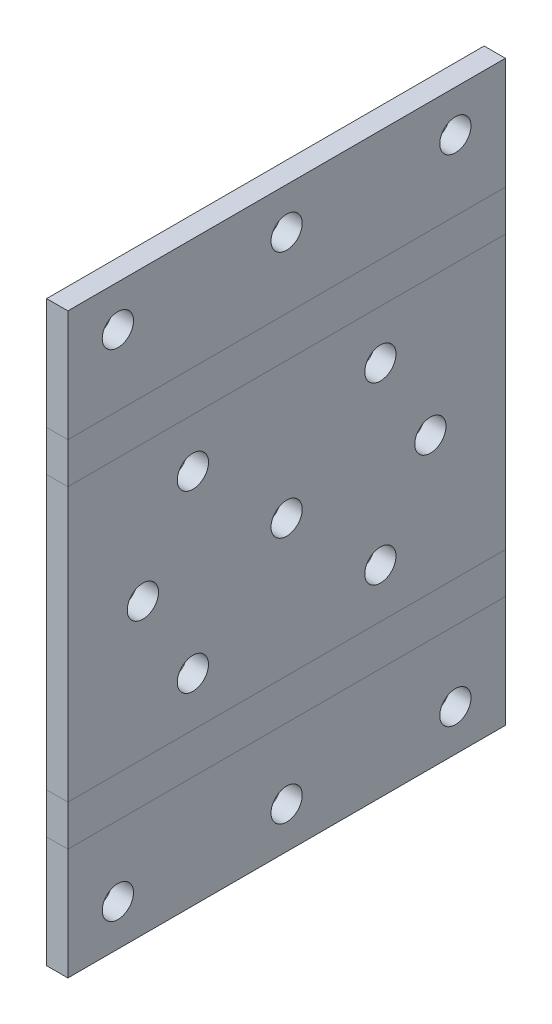
ISO-10303-21;
HEADER;
FILE_DESCRIPTION(('STEP AP214'),'2;1');
FILE_NAME('part.step','',(''),(''),'','','');
FILE_SCHEMA(('AUTOMOTIVE_DESIGN { 1 0 10303 214 1 1 1 1 }'));
ENDSEC;
DATA;
#1=APPLICATION_CONTEXT('core data for automotive mechanical design processes');
#2=APPLICATION_PROTOCOL_DEFINITION('international standard','automotive_design',2000,#1);
#3=PRODUCT_CONTEXT('',#1,'mechanical');
#4=PRODUCT('Part','Part','',(#3));
#5=PRODUCT_RELATED_PRODUCT_CATEGORY('part','',(#4));
#6=PRODUCT_DEFINITION_FORMATION('','',#4);
#7=PRODUCT_DEFINITION_CONTEXT('part definition',#1,'design');
#8=PRODUCT_DEFINITION('design','',#6,#7);
#9=PRODUCT_DEFINITION_SHAPE('','',#8);
#10=(LENGTH_UNIT() NAMED_UNIT(*) SI_UNIT(.MILLI.,.METRE.));
#11=(NAMED_UNIT(*) PLANE_ANGLE_UNIT() SI_UNIT($,.RADIAN.));
#12=(NAMED_UNIT(*) SI_UNIT($,.STERADIAN.) SOLID_ANGLE_UNIT());
#13=UNCERTAINTY_MEASURE_WITH_UNIT(LENGTH_MEASURE(1.E-05),#10,'distance_accuracy_value','');
#14=(GEOMETRIC_REPRESENTATION_CONTEXT(3) GLOBAL_UNCERTAINTY_ASSIGNED_CONTEXT((#13)) GLOBAL_UNIT_ASSIGNED_CONTEXT((#10,
#11,#12)) REPRESENTATION_CONTEXT('',''));
#15=CARTESIAN_POINT('',(0.,0.,0.));
#16=DIRECTION('',(0.,0.,1.));
#17=DIRECTION('',(1.,0.,0.));
#18=AXIS2_PLACEMENT_3D('',#15,#16,#17);
#19=CARTESIAN_POINT('',(-3.40000000000001,26.,70.));
#20=DIRECTION('',(1.,0.,0.));
#21=DIRECTION('',(0.,1.,0.));
#22=AXIS2_PLACEMENT_3D('',#19,#20,#21);
#23=PLANE('',#22);
#24=CARTESIAN_POINT('',(-3.4,-3.21964792834985E-13,34.9999999999981));
#25=DIRECTION('',(-1.,0.,0.));
#26=DIRECTION('',(0.,-1.,0.));
#27=AXIS2_PLACEMENT_3D('',#24,#25,#26);
#28=CIRCLE('',#27,2.50000000000195);
#29=CARTESIAN_POINT('',(-3.4,-2.50000000000228,34.9999999999981));
#30=VERTEX_POINT('',#29);
#31=EDGE_CURVE('E337',#30,#30,#28,.T.);
#32=ORIENTED_EDGE('',*,*,#31,.F.);
#33=EDGE_LOOP('',(#32));
#34=FACE_BOUND('',#33,.T.);
#35=CARTESIAN_POINT('',(-3.40000000000001,13.9999999999997,49.9999999999964));
#36=DIRECTION('',(-1.,0.,0.));
#37=DIRECTION('',(0.,-1.,0.));
#38=AXIS2_PLACEMENT_3D('',#35,#36,#37);
#39=CIRCLE('',#38,2.4999999999999);
#40=CARTESIAN_POINT('',(-3.4,11.4999999999998,49.9999999999964));
#41=VERTEX_POINT('',#40);
#42=EDGE_CURVE('E328',#41,#41,#39,.T.);
#43=ORIENTED_EDGE('',*,*,#42,.F.);
#44=EDGE_LOOP('',(#43));
#45=FACE_BOUND('',#44,.T.);
#46=CARTESIAN_POINT('',(-3.4,-3.20230069359008E-13,57.9999999999981));
#47=DIRECTION('',(-1.,0.,0.));
#48=DIRECTION('',(0.,-1.,0.));
#49=AXIS2_PLACEMENT_3D('',#46,#47,#48);
#50=CIRCLE('',#49,2.50000000000106);
#51=CARTESIAN_POINT('',(-3.4,-2.50000000000138,57.9999999999981));
#52=VERTEX_POINT('',#51);
#53=EDGE_CURVE('E312',#52,#52,#50,.T.);
#54=ORIENTED_EDGE('',*,*,#53,.F.);
#55=EDGE_LOOP('',(#54));
#56=FACE_BOUND('',#55,.T.);
#57=CARTESIAN_POINT('',(-3.4,-14.0000000000003,19.9999999999997));
#58=DIRECTION('',(-1.,0.,0.));
#59=DIRECTION('',(0.,-1.,0.));
#60=AXIS2_PLACEMENT_3D('',#57,#58,#59);
#61=CIRCLE('',#60,2.49999999999998);
#62=CARTESIAN_POINT('',(-3.4,-16.5000000000003,19.9999999999997));
#63=VERTEX_POINT('',#62);
#64=EDGE_CURVE('E348',#63,#63,#61,.T.);
#65=ORIENTED_EDGE('',*,*,#64,.F.);
#66=EDGE_LOOP('',(#65));
#67=FACE_BOUND('',#66,.T.);
#68=DIRECTION('',(0.,0.,-1.));
#69=VECTOR('',#68,1.);
#70=CARTESIAN_POINT('',(-3.39999999999999,-21.85,70.));
#71=LINE('',#70,#69);
#72=CARTESIAN_POINT('',(-3.39999999999999,-21.85,70.));
#73=VERTEX_POINT('',#72);
#74=CARTESIAN_POINT('',(-3.39999999999999,-21.85,0.));
#75=VERTEX_POINT('',#74);
#76=EDGE_CURVE('E385',#73,#75,#71,.T.);
#77=ORIENTED_EDGE('',*,*,#76,.F.);
#78=DIRECTION('',(0.,-1.,0.));
#79=VECTOR('',#78,1.);
#80=CARTESIAN_POINT('',(-3.40000000000001,26.,70.));
#81=LINE('',#80,#79);
#82=CARTESIAN_POINT('',(-3.4,21.85,70.));
#83=VERTEX_POINT('',#82);
#84=EDGE_CURVE('E97',#83,#73,#81,.T.);
#85=ORIENTED_EDGE('',*,*,#84,.F.);
#86=DIRECTION('',(0.,0.,1.));
#87=VECTOR('',#86,1.);
#88=CARTESIAN_POINT('',(-3.4,21.85,0.));
#89=LINE('',#88,#87);
#90=CARTESIAN_POINT('',(-3.4,21.85,0.));
#91=VERTEX_POINT('',#90);
#92=EDGE_CURVE('E90',#91,#83,#89,.T.);
#93=ORIENTED_EDGE('',*,*,#92,.F.);
#94=DIRECTION('',(0.,-1.,0.));
#95=VECTOR('',#94,1.);
#96=CARTESIAN_POINT('',(-3.40000000000001,26.,0.));
#97=LINE('',#96,#95);
#98=EDGE_CURVE('E105',#91,#75,#97,.T.);
#99=ORIENTED_EDGE('',*,*,#98,.T.);
#100=EDGE_LOOP('',(#77,#85,#93,#99));
#101=FACE_BOUND('',#100,.T.);
#102=CARTESIAN_POINT('',(-3.4,-3.23046756997047E-13,11.9999999999981));
#103=DIRECTION('',(1.,0.,0.));
#104=DIRECTION('',(0.,1.,0.));
#105=AXIS2_PLACEMENT_3D('',#102,#103,#104);
#106=CIRCLE('',#105,2.50000000000106);
#107=CARTESIAN_POINT('',(-3.4,2.50000000000074,11.9999999999981));
#108=VERTEX_POINT('',#107);
#109=EDGE_CURVE('E321',#108,#108,#106,.T.);
#110=ORIENTED_EDGE('',*,*,#109,.T.);
#111=EDGE_LOOP('',(#110));
#112=FACE_BOUND('',#111,.T.);
#113=CARTESIAN_POINT('',(-3.4,-14.0000000000003,49.9999999999964));
#114=DIRECTION('',(-1.,0.,0.));
#115=DIRECTION('',(0.,-1.,0.));
#116=AXIS2_PLACEMENT_3D('',#113,#114,#115);
#117=CIRCLE('',#116,2.5);
#118=CARTESIAN_POINT('',(-3.4,-16.5000000000003,49.9999999999964));
#119=VERTEX_POINT('',#118);
#120=EDGE_CURVE('E344',#119,#119,#117,.F.);
#121=ORIENTED_EDGE('',*,*,#120,.T.);
#122=EDGE_LOOP('',(#121));
#123=FACE_BOUND('',#122,.T.);
#124=CARTESIAN_POINT('',(-3.40000000000001,13.9999999999997,19.9999999999997));
#125=DIRECTION('',(1.,0.,0.));
#126=DIRECTION('',(0.,1.,0.));
#127=AXIS2_PLACEMENT_3D('',#124,#125,#126);
#128=CIRCLE('',#127,2.5);
#129=CARTESIAN_POINT('',(-3.40000000000001,16.4999999999997,19.9999999999997));
#130=VERTEX_POINT('',#129);
#131=EDGE_CURVE('E353',#130,#130,#128,.T.);
#132=ORIENTED_EDGE('',*,*,#131,.T.);
#133=EDGE_LOOP('',(#132));
#134=FACE_BOUND('',#133,.T.);
#135=ADVANCED_FACE('F82',(#34,#45,#56,#67,#101,#112,#123,#134),#23,.F.);
#136=CARTESIAN_POINT('',(0.,26.,70.));
#137=DIRECTION('',(1.,0.,0.));
#138=DIRECTION('',(0.,1.,0.));
#139=AXIS2_PLACEMENT_3D('',#136,#137,#138);
#140=PLANE('',#139);
#141=CARTESIAN_POINT('',(0.,-3.20923843055709E-13,34.9999999999981));
#142=DIRECTION('',(-1.,0.,0.));
#143=DIRECTION('',(0.,-1.,0.));
#144=AXIS2_PLACEMENT_3D('',#141,#142,#143);
#145=CIRCLE('',#144,2.50000000000195);
#146=CARTESIAN_POINT('',(0.,-2.50000000000228,34.9999999999981));
#147=VERTEX_POINT('',#146);
#148=EDGE_CURVE('E316',#147,#147,#145,.T.);
#149=ORIENTED_EDGE('',*,*,#148,.T.);
#150=EDGE_LOOP('',(#149));
#151=FACE_BOUND('',#150,.T.);
#152=CARTESIAN_POINT('',(0.,13.9999999999997,49.9999999999964));
#153=DIRECTION('',(-1.,0.,0.));
#154=DIRECTION('',(0.,-1.,0.));
#155=AXIS2_PLACEMENT_3D('',#152,#153,#154);
#156=CIRCLE('',#155,2.4999999999999);
#157=CARTESIAN_POINT('',(0.,11.4999999999998,49.9999999999964));
#158=VERTEX_POINT('',#157);
#159=EDGE_CURVE('E333',#158,#158,#156,.T.);
#160=ORIENTED_EDGE('',*,*,#159,.T.);
#161=EDGE_LOOP('',(#160));
#162=FACE_BOUND('',#161,.T.);
#163=CARTESIAN_POINT('',(0.,-14.0000000000003,49.9999999999964));
#164=DIRECTION('',(-1.,0.,0.));
#165=DIRECTION('',(0.,-1.,0.));
#166=AXIS2_PLACEMENT_3D('',#163,#164,#165);
#167=CIRCLE('',#166,2.5);
#168=CARTESIAN_POINT('',(0.,-16.5000000000003,49.9999999999964));
#169=VERTEX_POINT('',#168);
#170=EDGE_CURVE('E349',#169,#169,#167,.F.);
#171=ORIENTED_EDGE('',*,*,#170,.F.);
#172=EDGE_LOOP('',(#171));
#173=FACE_BOUND('',#172,.T.);
#174=CARTESIAN_POINT('',(0.,-3.19189119579732E-13,57.9999999999981));
#175=DIRECTION('',(-1.,0.,0.));
#176=DIRECTION('',(0.,-1.,0.));
#177=AXIS2_PLACEMENT_3D('',#174,#175,#176);
#178=CIRCLE('',#177,2.50000000000106);
#179=CARTESIAN_POINT('',(0.,-2.50000000000138,57.9999999999981));
#180=VERTEX_POINT('',#179);
#181=EDGE_CURVE('E317',#180,#180,#178,.T.);
#182=ORIENTED_EDGE('',*,*,#181,.T.);
#183=EDGE_LOOP('',(#182));
#184=FACE_BOUND('',#183,.T.);
#185=DIRECTION('',(0.,-1.,0.));
#186=VECTOR('',#185,1.);
#187=CARTESIAN_POINT('',(0.,26.,70.));
#188=LINE('',#187,#186);
#189=CARTESIAN_POINT('',(0.,21.85,70.));
#190=VERTEX_POINT('',#189);
#191=CARTESIAN_POINT('',(0.,-21.85,70.));
#192=VERTEX_POINT('',#191);
#193=EDGE_CURVE('E369',#190,#192,#188,.T.);
#194=ORIENTED_EDGE('',*,*,#193,.T.);
#195=DIRECTION('',(0.,0.,-1.));
#196=VECTOR('',#195,1.);
#197=CARTESIAN_POINT('',(0.,-21.85,70.));
#198=LINE('',#197,#196);
#199=CARTESIAN_POINT('',(0.,-21.85,0.));
#200=VERTEX_POINT('',#199);
#201=EDGE_CURVE('E373',#192,#200,#198,.T.);
#202=ORIENTED_EDGE('',*,*,#201,.T.);
#203=DIRECTION('',(0.,-1.,0.));
#204=VECTOR('',#203,1.);
#205=CARTESIAN_POINT('',(0.,26.,0.));
#206=LINE('',#205,#204);
#207=CARTESIAN_POINT('',(0.,21.85,0.));
#208=VERTEX_POINT('',#207);
#209=EDGE_CURVE('E370',#208,#200,#206,.T.);
#210=ORIENTED_EDGE('',*,*,#209,.F.);
#211=DIRECTION('',(0.,0.,1.));
#212=VECTOR('',#211,1.);
#213=CARTESIAN_POINT('',(0.,21.85,0.));
#214=LINE('',#213,#212);
#215=EDGE_CURVE('E393',#208,#190,#214,.T.);
#216=ORIENTED_EDGE('',*,*,#215,.T.);
#217=EDGE_LOOP('',(#194,#202,#210,#216));
#218=FACE_BOUND('',#217,.T.);
#219=CARTESIAN_POINT('',(0.,-14.0000000000003,19.9999999999997));
#220=DIRECTION('',(-1.,0.,0.));
#221=DIRECTION('',(0.,-1.,0.));
#222=AXIS2_PLACEMENT_3D('',#219,#220,#221);
#223=CIRCLE('',#222,2.49999999999998);
#224=CARTESIAN_POINT('',(0.,-16.5000000000003,19.9999999999997));
#225=VERTEX_POINT('',#224);
#226=EDGE_CURVE('E360',#225,#225,#223,.T.);
#227=ORIENTED_EDGE('',*,*,#226,.T.);
#228=EDGE_LOOP('',(#227));
#229=FACE_BOUND('',#228,.T.);
#230=CARTESIAN_POINT('',(0.,-3.22005807217771E-13,11.9999999999981));
#231=DIRECTION('',(1.,0.,0.));
#232=DIRECTION('',(0.,1.,0.));
#233=AXIS2_PLACEMENT_3D('',#230,#231,#232);
#234=CIRCLE('',#233,2.50000000000106);
#235=CARTESIAN_POINT('',(0.,2.50000000000074,11.9999999999981));
#236=VERTEX_POINT('',#235);
#237=EDGE_CURVE('E305',#236,#236,#234,.T.);
#238=ORIENTED_EDGE('',*,*,#237,.F.);
#239=EDGE_LOOP('',(#238));
#240=FACE_BOUND('',#239,.T.);
#241=CARTESIAN_POINT('',(0.,13.9999999999997,19.9999999999997));
#242=DIRECTION('',(1.,0.,0.));
#243=DIRECTION('',(0.,1.,0.));
#244=AXIS2_PLACEMENT_3D('',#241,#242,#243);
#245=CIRCLE('',#244,2.5);
#246=CARTESIAN_POINT('',(0.,16.4999999999997,19.9999999999997));
#247=VERTEX_POINT('',#246);
#248=EDGE_CURVE('E332',#247,#247,#245,.T.);
#249=ORIENTED_EDGE('',*,*,#248,.F.);
#250=EDGE_LOOP('',(#249));
#251=FACE_BOUND('',#250,.T.);
#252=ADVANCED_FACE('F467',(#151,#162,#173,#184,#218,#229,#240,#251),#140,.T.);
#253=CARTESIAN_POINT('',(0.,0.,70.));
#254=DIRECTION('',(0.,0.,-1.));
#255=DIRECTION('',(-1.,0.,0.));
#256=AXIS2_PLACEMENT_3D('',#253,#254,#255);
#257=PLANE('',#256);
#258=DIRECTION('',(1.,0.,0.));
#259=VECTOR('',#258,1.);
#260=CARTESIAN_POINT('',(-3.39999999999999,-21.85,70.));
#261=LINE('',#260,#259);
#262=EDGE_CURVE('E381',#73,#192,#261,.T.);
#263=ORIENTED_EDGE('',*,*,#262,.T.);
#264=ORIENTED_EDGE('',*,*,#193,.F.);
#265=DIRECTION('',(1.,0.,0.));
#266=VECTOR('',#265,1.);
#267=CARTESIAN_POINT('',(-3.4,21.85,70.));
#268=LINE('',#267,#266);
#269=EDGE_CURVE('E13',#83,#190,#268,.T.);
#270=ORIENTED_EDGE('',*,*,#269,.F.);
#271=ORIENTED_EDGE('',*,*,#84,.T.);
#272=EDGE_LOOP('',(#263,#264,#270,#271));
#273=FACE_BOUND('',#272,.T.);
#274=ADVANCED_FACE('F473',(#273),#257,.F.);
#275=CARTESIAN_POINT('',(0.,0.,0.));
#276=DIRECTION('',(0.,0.,-1.));
#277=DIRECTION('',(-1.,0.,0.));
#278=AXIS2_PLACEMENT_3D('',#275,#276,#277);
#279=PLANE('',#278);
#280=DIRECTION('',(1.,0.,0.));
#281=VECTOR('',#280,1.);
#282=CARTESIAN_POINT('',(-3.39999999999999,-21.85,0.));
#283=LINE('',#282,#281);
#284=EDGE_CURVE('E389',#75,#200,#283,.T.);
#285=ORIENTED_EDGE('',*,*,#284,.F.);
#286=ORIENTED_EDGE('',*,*,#98,.F.);
#287=DIRECTION('',(1.,0.,0.));
#288=VECTOR('',#287,1.);
#289=CARTESIAN_POINT('',(-3.4,21.85,0.));
#290=LINE('',#289,#288);
#291=EDGE_CURVE('E397',#91,#208,#290,.T.);
#292=ORIENTED_EDGE('',*,*,#291,.T.);
#293=ORIENTED_EDGE('',*,*,#209,.T.);
#294=EDGE_LOOP('',(#285,#286,#292,#293));
#295=FACE_BOUND('',#294,.T.);
#296=ADVANCED_FACE('F512',(#295),#279,.T.);
#297=CARTESIAN_POINT('',(0.,-14.0000000000003,19.9999999999997));
#298=DIRECTION('',(-1.,0.,0.));
#299=DIRECTION('',(0.,-1.,0.));
#300=AXIS2_PLACEMENT_3D('',#297,#298,#299);
#301=CYLINDRICAL_SURFACE('',#300,2.49999999999998);
#302=ORIENTED_EDGE('',*,*,#226,.F.);
#303=EDGE_LOOP('',(#302));
#304=FACE_BOUND('',#303,.T.);
#305=ORIENTED_EDGE('',*,*,#64,.T.);
#306=EDGE_LOOP('',(#305));
#307=FACE_BOUND('',#306,.T.);
#308=ADVANCED_FACE('F508',(#304,#307),#301,.F.);
#309=CARTESIAN_POINT('',(0.,-3.22005807217771E-13,11.9999999999981));
#310=DIRECTION('',(-1.,0.,0.));
#311=DIRECTION('',(0.,-1.,0.));
#312=AXIS2_PLACEMENT_3D('',#309,#310,#311);
#313=CYLINDRICAL_SURFACE('',#312,2.50000000000106);
#314=ORIENTED_EDGE('',*,*,#237,.T.);
#315=EDGE_LOOP('',(#314));
#316=FACE_BOUND('',#315,.T.);
#317=ORIENTED_EDGE('',*,*,#109,.F.);
#318=EDGE_LOOP('',(#317));
#319=FACE_BOUND('',#318,.T.);
#320=ADVANCED_FACE('F511',(#316,#319),#313,.F.);
#321=CARTESIAN_POINT('',(0.,-3.19189119579732E-13,57.9999999999981));
#322=DIRECTION('',(-1.,0.,0.));
#323=DIRECTION('',(0.,-1.,0.));
#324=AXIS2_PLACEMENT_3D('',#321,#322,#323);
#325=CYLINDRICAL_SURFACE('',#324,2.50000000000106);
#326=ORIENTED_EDGE('',*,*,#181,.F.);
#327=EDGE_LOOP('',(#326));
#328=FACE_BOUND('',#327,.T.);
#329=ORIENTED_EDGE('',*,*,#53,.T.);
#330=EDGE_LOOP('',(#329));
#331=FACE_BOUND('',#330,.T.);
#332=ADVANCED_FACE('F503',(#328,#331),#325,.F.);
#333=CARTESIAN_POINT('',(0.,-14.0000000000003,49.9999999999964));
#334=DIRECTION('',(-1.,0.,0.));
#335=DIRECTION('',(0.,-1.,0.));
#336=AXIS2_PLACEMENT_3D('',#333,#334,#335);
#337=CYLINDRICAL_SURFACE('',#336,2.5);
#338=ORIENTED_EDGE('',*,*,#170,.T.);
#339=EDGE_LOOP('',(#338));
#340=FACE_BOUND('',#339,.T.);
#341=ORIENTED_EDGE('',*,*,#120,.F.);
#342=EDGE_LOOP('',(#341));
#343=FACE_BOUND('',#342,.T.);
#344=ADVANCED_FACE('F493',(#340,#343),#337,.F.);
#345=CARTESIAN_POINT('',(0.,13.9999999999997,19.9999999999997));
#346=DIRECTION('',(-1.,0.,0.));
#347=DIRECTION('',(0.,-1.,0.));
#348=AXIS2_PLACEMENT_3D('',#345,#346,#347);
#349=CYLINDRICAL_SURFACE('',#348,2.5);
#350=ORIENTED_EDGE('',*,*,#248,.T.);
#351=EDGE_LOOP('',(#350));
#352=FACE_BOUND('',#351,.T.);
#353=ORIENTED_EDGE('',*,*,#131,.F.);
#354=EDGE_LOOP('',(#353));
#355=FACE_BOUND('',#354,.T.);
#356=ADVANCED_FACE('F490',(#352,#355),#349,.F.);
#357=CARTESIAN_POINT('',(0.,13.9999999999997,49.9999999999964));
#358=DIRECTION('',(-1.,0.,0.));
#359=DIRECTION('',(0.,-1.,0.));
#360=AXIS2_PLACEMENT_3D('',#357,#358,#359);
#361=CYLINDRICAL_SURFACE('',#360,2.4999999999999);
#362=ORIENTED_EDGE('',*,*,#159,.F.);
#363=EDGE_LOOP('',(#362));
#364=FACE_BOUND('',#363,.T.);
#365=ORIENTED_EDGE('',*,*,#42,.T.);
#366=EDGE_LOOP('',(#365));
#367=FACE_BOUND('',#366,.T.);
#368=ADVANCED_FACE('F492',(#364,#367),#361,.F.);
#369=CARTESIAN_POINT('',(0.,-3.20923843055709E-13,34.9999999999981));
#370=DIRECTION('',(-1.,0.,0.));
#371=DIRECTION('',(0.,-1.,0.));
#372=AXIS2_PLACEMENT_3D('',#369,#370,#371);
#373=CYLINDRICAL_SURFACE('',#372,2.50000000000195);
#374=ORIENTED_EDGE('',*,*,#148,.F.);
#375=EDGE_LOOP('',(#374));
#376=FACE_BOUND('',#375,.T.);
#377=ORIENTED_EDGE('',*,*,#31,.T.);
#378=EDGE_LOOP('',(#377));
#379=FACE_BOUND('',#378,.T.);
#380=ADVANCED_FACE('F500',(#376,#379),#373,.F.);
#381=CARTESIAN_POINT('',(0.,-28.3688047561988,70.));
#382=DIRECTION('',(0.,0.,1.));
#383=DIRECTION('',(0.,-1.,0.));
#384=AXIS2_PLACEMENT_3D('',#381,#382,#383);
#385=PLANE('',#384);
#386=ORIENTED_EDGE('',*,*,#262,.F.);
#387=DIRECTION('',(0.,1.,0.));
#388=VECTOR('',#387,1.);
#389=CARTESIAN_POINT('',(-3.39999999999999,-25.1094023780994,70.));
#390=LINE('',#389,#388);
#391=CARTESIAN_POINT('',(-3.39999999999999,-28.3688047561989,70.));
#392=VERTEX_POINT('',#391);
#393=EDGE_CURVE('E233',#73,#392,#390,.F.);
#394=ORIENTED_EDGE('',*,*,#393,.T.);
#395=DIRECTION('',(1.,0.,0.));
#396=VECTOR('',#395,1.);
#397=CARTESIAN_POINT('',(-3.39999999999999,-28.3688047561989,70.));
#398=LINE('',#397,#396);
#399=CARTESIAN_POINT('',(0.,-28.3688047561988,70.));
#400=VERTEX_POINT('',#399);
#401=EDGE_CURVE('E285',#392,#400,#398,.T.);
#402=ORIENTED_EDGE('',*,*,#401,.T.);
#403=DIRECTION('',(0.,-1.,0.));
#404=VECTOR('',#403,1.);
#405=CARTESIAN_POINT('',(0.,-28.3688047561988,70.));
#406=LINE('',#405,#404);
#407=EDGE_CURVE('E296',#192,#400,#406,.T.);
#408=ORIENTED_EDGE('',*,*,#407,.F.);
#409=EDGE_LOOP('',(#386,#394,#402,#408));
#410=FACE_BOUND('',#409,.T.);
#411=ADVANCED_FACE('F544',(#410),#385,.T.);
#412=CARTESIAN_POINT('',(0.,-21.85,0.));
#413=DIRECTION('',(0.,0.,-1.));
#414=DIRECTION('',(0.,1.,0.));
#415=AXIS2_PLACEMENT_3D('',#412,#413,#414);
#416=PLANE('',#415);
#417=DIRECTION('',(0.,1.,0.));
#418=VECTOR('',#417,1.);
#419=CARTESIAN_POINT('',(-3.39999999999999,-25.1094023780994,0.));
#420=LINE('',#419,#418);
#421=CARTESIAN_POINT('',(-3.39999999999999,-28.3688047561989,0.));
#422=VERTEX_POINT('',#421);
#423=EDGE_CURVE('E301',#422,#75,#420,.T.);
#424=ORIENTED_EDGE('',*,*,#423,.T.);
#425=ORIENTED_EDGE('',*,*,#284,.T.);
#426=DIRECTION('',(0.,1.,0.));
#427=VECTOR('',#426,1.);
#428=CARTESIAN_POINT('',(0.,-21.85,0.));
#429=LINE('',#428,#427);
#430=CARTESIAN_POINT('',(0.,-28.3688047561988,0.));
#431=VERTEX_POINT('',#430);
#432=EDGE_CURVE('E300',#431,#200,#429,.T.);
#433=ORIENTED_EDGE('',*,*,#432,.F.);
#434=DIRECTION('',(1.,0.,0.));
#435=VECTOR('',#434,1.);
#436=CARTESIAN_POINT('',(0.,-28.3688047561988,0.));
#437=LINE('',#436,#435);
#438=EDGE_CURVE('E238',#422,#431,#437,.T.);
#439=ORIENTED_EDGE('',*,*,#438,.F.);
#440=EDGE_LOOP('',(#424,#425,#433,#439));
#441=FACE_BOUND('',#440,.T.);
#442=ADVANCED_FACE('F528',(#441),#416,.T.);
#443=CARTESIAN_POINT('',(0.,-25.1094023780994,35.));
#444=DIRECTION('',(1.,0.,0.));
#445=DIRECTION('',(0.,1.,0.));
#446=AXIS2_PLACEMENT_3D('',#443,#444,#445);
#447=PLANE('',#446);
#448=DIRECTION('',(0.,0.,-1.));
#449=VECTOR('',#448,1.);
#450=CARTESIAN_POINT('',(0.,-28.3688047561988,0.));
#451=LINE('',#450,#449);
#452=EDGE_CURVE('E222',#400,#431,#451,.T.);
#453=ORIENTED_EDGE('',*,*,#452,.T.);
#454=ORIENTED_EDGE('',*,*,#432,.T.);
#455=ORIENTED_EDGE('',*,*,#201,.F.);
#456=ORIENTED_EDGE('',*,*,#407,.T.);
#457=EDGE_LOOP('',(#453,#454,#455,#456));
#458=FACE_BOUND('',#457,.T.);
#459=ADVANCED_FACE('F540',(#458),#447,.T.);
#460=CARTESIAN_POINT('',(-3.39999999999999,-25.1094023780994,35.));
#461=DIRECTION('',(1.,0.,0.));
#462=DIRECTION('',(0.,1.,0.));
#463=AXIS2_PLACEMENT_3D('',#460,#461,#462);
#464=PLANE('',#463);
#465=DIRECTION('',(0.,0.,1.));
#466=VECTOR('',#465,1.);
#467=CARTESIAN_POINT('',(-3.39999999999999,-28.3688047561989,0.));
#468=LINE('',#467,#466);
#469=EDGE_CURVE('E289',#422,#392,#468,.T.);
#470=ORIENTED_EDGE('',*,*,#469,.T.);
#471=ORIENTED_EDGE('',*,*,#393,.F.);
#472=ORIENTED_EDGE('',*,*,#76,.T.);
#473=ORIENTED_EDGE('',*,*,#423,.F.);
#474=EDGE_LOOP('',(#470,#471,#472,#473));
#475=FACE_BOUND('',#474,.T.);
#476=ADVANCED_FACE('F526',(#475),#464,.F.);
#477=CARTESIAN_POINT('',(1.38777878078145E-13,-46.2188047561989,0.));
#478=DIRECTION('',(0.,1.,0.));
#479=DIRECTION('',(-1.,0.,0.));
#480=AXIS2_PLACEMENT_3D('',#477,#478,#479);
#481=PLANE('',#480);
#482=DIRECTION('',(0.,0.,1.));
#483=VECTOR('',#482,1.);
#484=CARTESIAN_POINT('',(-3.39999999999986,-46.2188047561989,0.));
#485=LINE('',#484,#483);
#486=CARTESIAN_POINT('',(-3.39999999999986,-46.2188047561989,70.));
#487=VERTEX_POINT('',#486);
#488=CARTESIAN_POINT('',(-3.39999999999986,-46.2188047561989,0.));
#489=VERTEX_POINT('',#488);
#490=EDGE_CURVE('E282',#487,#489,#485,.F.);
#491=ORIENTED_EDGE('',*,*,#490,.T.);
#492=DIRECTION('',(-1.,0.,0.));
#493=VECTOR('',#492,1.);
#494=CARTESIAN_POINT('',(1.38777878078145E-13,-46.2188047561989,0.));
#495=LINE('',#494,#493);
#496=CARTESIAN_POINT('',(1.38777878078145E-13,-46.2188047561989,0.));
#497=VERTEX_POINT('',#496);
#498=EDGE_CURVE('E234',#497,#489,#495,.T.);
#499=ORIENTED_EDGE('',*,*,#498,.F.);
#500=DIRECTION('',(0.,0.,-1.));
#501=VECTOR('',#500,1.);
#502=CARTESIAN_POINT('',(1.38777878078145E-13,-46.2188047561989,0.));
#503=LINE('',#502,#501);
#504=CARTESIAN_POINT('',(1.38777878078145E-13,-46.2188047561989,70.));
#505=VERTEX_POINT('',#504);
#506=EDGE_CURVE('E248',#505,#497,#503,.T.);
#507=ORIENTED_EDGE('',*,*,#506,.F.);
#508=DIRECTION('',(-1.,0.,0.));
#509=VECTOR('',#508,1.);
#510=CARTESIAN_POINT('',(1.38777878078145E-13,-46.2188047561989,70.));
#511=LINE('',#510,#509);
#512=EDGE_CURVE('E278',#505,#487,#511,.T.);
#513=ORIENTED_EDGE('',*,*,#512,.T.);
#514=EDGE_LOOP('',(#491,#499,#507,#513));
#515=FACE_BOUND('',#514,.T.);
#516=ADVANCED_FACE('F553',(#515),#481,.F.);
#517=CARTESIAN_POINT('',(-52.0000000000001,-39.618804756199,35.));
#518=DIRECTION('',(1.,0.,0.));
#519=DIRECTION('',(0.,1.,0.));
#520=AXIS2_PLACEMENT_3D('',#517,#518,#519);
#521=CYLINDRICAL_SURFACE('',#520,2.5);
#522=CARTESIAN_POINT('',(-3.39999999999992,-39.618804756199,35.));
#523=DIRECTION('',(-1.,0.,0.));
#524=DIRECTION('',(0.,-1.,0.));
#525=AXIS2_PLACEMENT_3D('',#522,#523,#524);
#526=CIRCLE('',#525,2.5);
#527=CARTESIAN_POINT('',(-3.3999999999999,-42.118804756199,35.));
#528=VERTEX_POINT('',#527);
#529=EDGE_CURVE('E274',#528,#528,#526,.T.);
#530=ORIENTED_EDGE('',*,*,#529,.T.);
#531=EDGE_LOOP('',(#530));
#532=FACE_BOUND('',#531,.T.);
#533=CARTESIAN_POINT('',(1.38777878078145E-13,-39.618804756199,35.));
#534=DIRECTION('',(1.,0.,0.));
#535=DIRECTION('',(0.,1.,0.));
#536=AXIS2_PLACEMENT_3D('',#533,#534,#535);
#537=CIRCLE('',#536,2.5);
#538=CARTESIAN_POINT('',(1.37886780797197E-13,-37.118804756199,35.));
#539=VERTEX_POINT('',#538);
#540=EDGE_CURVE('E270',#539,#539,#537,.T.);
#541=ORIENTED_EDGE('',*,*,#540,.T.);
#542=EDGE_LOOP('',(#541));
#543=FACE_BOUND('',#542,.T.);
#544=ADVANCED_FACE('F555',(#532,#543),#521,.F.);
#545=CARTESIAN_POINT('',(-52.0000000000001,-39.618804756199,8.));
#546=DIRECTION('',(1.,0.,0.));
#547=DIRECTION('',(0.,1.,0.));
#548=AXIS2_PLACEMENT_3D('',#545,#546,#547);
#549=CYLINDRICAL_SURFACE('',#548,2.5);
#550=CARTESIAN_POINT('',(-3.39999999999992,-39.618804756199,8.));
#551=DIRECTION('',(-1.,0.,0.));
#552=DIRECTION('',(0.,-1.,0.));
#553=AXIS2_PLACEMENT_3D('',#550,#551,#552);
#554=CIRCLE('',#553,2.5);
#555=CARTESIAN_POINT('',(-3.3999999999999,-42.118804756199,8.));
#556=VERTEX_POINT('',#555);
#557=EDGE_CURVE('E266',#556,#556,#554,.T.);
#558=ORIENTED_EDGE('',*,*,#557,.T.);
#559=EDGE_LOOP('',(#558));
#560=FACE_BOUND('',#559,.T.);
#561=CARTESIAN_POINT('',(1.38777878078145E-13,-39.618804756199,8.));
#562=DIRECTION('',(1.,0.,0.));
#563=DIRECTION('',(0.,1.,0.));
#564=AXIS2_PLACEMENT_3D('',#561,#562,#563);
#565=CIRCLE('',#564,2.5);
#566=CARTESIAN_POINT('',(1.37886780797197E-13,-37.118804756199,8.));
#567=VERTEX_POINT('',#566);
#568=EDGE_CURVE('E262',#567,#567,#565,.T.);
#569=ORIENTED_EDGE('',*,*,#568,.T.);
#570=EDGE_LOOP('',(#569));
#571=FACE_BOUND('',#570,.T.);
#572=ADVANCED_FACE('F561',(#560,#571),#549,.F.);
#573=CARTESIAN_POINT('',(-52.0000000000001,-39.618804756199,62.));
#574=DIRECTION('',(1.,0.,0.));
#575=DIRECTION('',(0.,1.,0.));
#576=AXIS2_PLACEMENT_3D('',#573,#574,#575);
#577=CYLINDRICAL_SURFACE('',#576,2.5);
#578=CARTESIAN_POINT('',(-3.39999999999992,-39.618804756199,62.));
#579=DIRECTION('',(-1.,0.,0.));
#580=DIRECTION('',(0.,-1.,0.));
#581=AXIS2_PLACEMENT_3D('',#578,#579,#580);
#582=CIRCLE('',#581,2.5);
#583=CARTESIAN_POINT('',(-3.3999999999999,-42.118804756199,62.));
#584=VERTEX_POINT('',#583);
#585=EDGE_CURVE('E258',#584,#584,#582,.T.);
#586=ORIENTED_EDGE('',*,*,#585,.T.);
#587=EDGE_LOOP('',(#586));
#588=FACE_BOUND('',#587,.T.);
#589=CARTESIAN_POINT('',(1.38777878078145E-13,-39.618804756199,62.));
#590=DIRECTION('',(1.,0.,0.));
#591=DIRECTION('',(0.,-1.,0.));
#592=AXIS2_PLACEMENT_3D('',#589,#590,#591);
#593=CIRCLE('',#592,2.5);
#594=CARTESIAN_POINT('',(1.39668975359092E-13,-42.118804756199,62.));
#595=VERTEX_POINT('',#594);
#596=EDGE_CURVE('E254',#595,#595,#593,.T.);
#597=ORIENTED_EDGE('',*,*,#596,.T.);
#598=EDGE_LOOP('',(#597));
#599=FACE_BOUND('',#598,.T.);
#600=ADVANCED_FACE('F571',(#588,#599),#577,.F.);
#601=CARTESIAN_POINT('',(0.,-24.2188047561988,0.));
#602=DIRECTION('',(-1.,0.,0.));
#603=DIRECTION('',(0.,-1.,0.));
#604=AXIS2_PLACEMENT_3D('',#601,#602,#603);
#605=PLANE('',#604);
#606=ORIENTED_EDGE('',*,*,#596,.F.);
#607=EDGE_LOOP('',(#606));
#608=FACE_BOUND('',#607,.T.);
#609=ORIENTED_EDGE('',*,*,#568,.F.);
#610=EDGE_LOOP('',(#609));
#611=FACE_BOUND('',#610,.T.);
#612=ORIENTED_EDGE('',*,*,#540,.F.);
#613=EDGE_LOOP('',(#612));
#614=FACE_BOUND('',#613,.T.);
#615=ORIENTED_EDGE('',*,*,#452,.F.);
#616=DIRECTION('',(0.,-1.,0.));
#617=VECTOR('',#616,1.);
#618=CARTESIAN_POINT('',(0.,-24.2188047561988,70.));
#619=LINE('',#618,#617);
#620=EDGE_CURVE('E251',#400,#505,#619,.T.);
#621=ORIENTED_EDGE('',*,*,#620,.T.);
#622=ORIENTED_EDGE('',*,*,#506,.T.);
#623=DIRECTION('',(0.,1.,0.));
#624=VECTOR('',#623,1.);
#625=CARTESIAN_POINT('',(0.,-24.2188047561988,0.));
#626=LINE('',#625,#624);
#627=EDGE_CURVE('E244',#497,#431,#626,.T.);
#628=ORIENTED_EDGE('',*,*,#627,.T.);
#629=EDGE_LOOP('',(#615,#621,#622,#628));
#630=FACE_BOUND('',#629,.T.);
#631=ADVANCED_FACE('F535',(#608,#611,#614,#630),#605,.F.);
#632=CARTESIAN_POINT('',(1.38777878078145E-13,-46.2188047561989,70.));
#633=DIRECTION('',(0.,0.,-1.));
#634=DIRECTION('',(0.,-1.,0.));
#635=AXIS2_PLACEMENT_3D('',#632,#633,#634);
#636=PLANE('',#635);
#637=ORIENTED_EDGE('',*,*,#401,.F.);
#638=DIRECTION('',(0.,1.,0.));
#639=VECTOR('',#638,1.);
#640=CARTESIAN_POINT('',(-3.39999999999986,-46.2188047561989,70.));
#641=LINE('',#640,#639);
#642=EDGE_CURVE('E241',#392,#487,#641,.F.);
#643=ORIENTED_EDGE('',*,*,#642,.T.);
#644=ORIENTED_EDGE('',*,*,#512,.F.);
#645=ORIENTED_EDGE('',*,*,#620,.F.);
#646=EDGE_LOOP('',(#637,#643,#644,#645));
#647=FACE_BOUND('',#646,.T.);
#648=ADVANCED_FACE('F547',(#647),#636,.F.);
#649=CARTESIAN_POINT('',(-3.40000000000002,-24.2188047561988,0.));
#650=DIRECTION('',(-1.,0.,0.));
#651=DIRECTION('',(0.,-1.,0.));
#652=AXIS2_PLACEMENT_3D('',#649,#650,#651);
#653=PLANE('',#652);
#654=ORIENTED_EDGE('',*,*,#585,.F.);
#655=EDGE_LOOP('',(#654));
#656=FACE_BOUND('',#655,.T.);
#657=ORIENTED_EDGE('',*,*,#557,.F.);
#658=EDGE_LOOP('',(#657));
#659=FACE_BOUND('',#658,.T.);
#660=ORIENTED_EDGE('',*,*,#529,.F.);
#661=EDGE_LOOP('',(#660));
#662=FACE_BOUND('',#661,.T.);
#663=ORIENTED_EDGE('',*,*,#642,.F.);
#664=ORIENTED_EDGE('',*,*,#469,.F.);
#665=DIRECTION('',(0.,-1.,0.));
#666=VECTOR('',#665,1.);
#667=CARTESIAN_POINT('',(-3.4,-27.6188047561989,0.));
#668=LINE('',#667,#666);
#669=EDGE_CURVE('E230',#489,#422,#668,.F.);
#670=ORIENTED_EDGE('',*,*,#669,.F.);
#671=ORIENTED_EDGE('',*,*,#490,.F.);
#672=EDGE_LOOP('',(#663,#664,#670,#671));
#673=FACE_BOUND('',#672,.T.);
#674=ADVANCED_FACE('F551',(#656,#659,#662,#673),#653,.T.);
#675=CARTESIAN_POINT('',(0.,-27.6188047561988,0.));
#676=DIRECTION('',(0.,0.,1.));
#677=DIRECTION('',(0.,1.,0.));
#678=AXIS2_PLACEMENT_3D('',#675,#676,#677);
#679=PLANE('',#678);
#680=ORIENTED_EDGE('',*,*,#438,.T.);
#681=ORIENTED_EDGE('',*,*,#627,.F.);
#682=ORIENTED_EDGE('',*,*,#498,.T.);
#683=ORIENTED_EDGE('',*,*,#669,.T.);
#684=EDGE_LOOP('',(#680,#681,#682,#683));
#685=FACE_BOUND('',#684,.T.);
#686=ADVANCED_FACE('F531',(#685),#679,.F.);
#687=CARTESIAN_POINT('',(0.,28.3688047561988,0.));
#688=DIRECTION('',(0.,0.,-1.));
#689=DIRECTION('',(0.,1.,0.));
#690=AXIS2_PLACEMENT_3D('',#687,#688,#689);
#691=PLANE('',#690);
#692=ORIENTED_EDGE('',*,*,#291,.F.);
#693=DIRECTION('',(0.,1.,0.));
#694=VECTOR('',#693,1.);
#695=CARTESIAN_POINT('',(-3.4,25.1094023780994,0.));
#696=LINE('',#695,#694);
#697=CARTESIAN_POINT('',(-3.40000000000001,28.3688047561989,0.));
#698=VERTEX_POINT('',#697);
#699=EDGE_CURVE('E223',#91,#698,#696,.T.);
#700=ORIENTED_EDGE('',*,*,#699,.T.);
#701=DIRECTION('',(1.,0.,0.));
#702=VECTOR('',#701,1.);
#703=CARTESIAN_POINT('',(-3.40000000000001,28.3688047561989,0.));
#704=LINE('',#703,#702);
#705=CARTESIAN_POINT('',(0.,28.3688047561988,0.));
#706=VERTEX_POINT('',#705);
#707=EDGE_CURVE('E179',#698,#706,#704,.T.);
#708=ORIENTED_EDGE('',*,*,#707,.T.);
#709=DIRECTION('',(0.,1.,0.));
#710=VECTOR('',#709,1.);
#711=CARTESIAN_POINT('',(0.,28.3688047561988,0.));
#712=LINE('',#711,#710);
#713=EDGE_CURVE('E213',#208,#706,#712,.T.);
#714=ORIENTED_EDGE('',*,*,#713,.F.);
#715=EDGE_LOOP('',(#692,#700,#708,#714));
#716=FACE_BOUND('',#715,.T.);
#717=ADVANCED_FACE('F586',(#716),#691,.T.);
#718=CARTESIAN_POINT('',(0.,21.85,70.));
#719=DIRECTION('',(0.,0.,1.));
#720=DIRECTION('',(0.,-1.,0.));
#721=AXIS2_PLACEMENT_3D('',#718,#719,#720);
#722=PLANE('',#721);
#723=DIRECTION('',(0.,1.,0.));
#724=VECTOR('',#723,1.);
#725=CARTESIAN_POINT('',(-3.4,25.1094023780994,70.));
#726=LINE('',#725,#724);
#727=CARTESIAN_POINT('',(-3.40000000000001,28.3688047561989,70.));
#728=VERTEX_POINT('',#727);
#729=EDGE_CURVE('E218',#728,#83,#726,.F.);
#730=ORIENTED_EDGE('',*,*,#729,.T.);
#731=ORIENTED_EDGE('',*,*,#269,.T.);
#732=DIRECTION('',(0.,-1.,0.));
#733=VECTOR('',#732,1.);
#734=CARTESIAN_POINT('',(0.,21.85,70.));
#735=LINE('',#734,#733);
#736=CARTESIAN_POINT('',(0.,28.3688047561988,70.));
#737=VERTEX_POINT('',#736);
#738=EDGE_CURVE('E217',#737,#190,#735,.T.);
#739=ORIENTED_EDGE('',*,*,#738,.F.);
#740=DIRECTION('',(1.,0.,0.));
#741=VECTOR('',#740,1.);
#742=CARTESIAN_POINT('',(0.,28.3688047561988,70.));
#743=LINE('',#742,#741);
#744=EDGE_CURVE('E185',#728,#737,#743,.T.);
#745=ORIENTED_EDGE('',*,*,#744,.F.);
#746=EDGE_LOOP('',(#730,#731,#739,#745));
#747=FACE_BOUND('',#746,.T.);
#748=ADVANCED_FACE('F408',(#747),#722,.T.);
#749=CARTESIAN_POINT('',(0.,25.1094023780994,35.));
#750=DIRECTION('',(1.,0.,0.));
#751=DIRECTION('',(0.,1.,0.));
#752=AXIS2_PLACEMENT_3D('',#749,#750,#751);
#753=PLANE('',#752);
#754=DIRECTION('',(0.,0.,1.));
#755=VECTOR('',#754,1.);
#756=CARTESIAN_POINT('',(0.,28.3688047561988,70.));
#757=LINE('',#756,#755);
#758=EDGE_CURVE('E209',#706,#737,#757,.T.);
#759=ORIENTED_EDGE('',*,*,#758,.T.);
#760=ORIENTED_EDGE('',*,*,#738,.T.);
#761=ORIENTED_EDGE('',*,*,#215,.F.);
#762=ORIENTED_EDGE('',*,*,#713,.T.);
#763=EDGE_LOOP('',(#759,#760,#761,#762));
#764=FACE_BOUND('',#763,.T.);
#765=ADVANCED_FACE('F621',(#764),#753,.T.);
#766=CARTESIAN_POINT('',(-3.4,25.1094023780994,35.));
#767=DIRECTION('',(1.,0.,0.));
#768=DIRECTION('',(0.,1.,0.));
#769=AXIS2_PLACEMENT_3D('',#766,#767,#768);
#770=PLANE('',#769);
#771=DIRECTION('',(0.,0.,-1.));
#772=VECTOR('',#771,1.);
#773=CARTESIAN_POINT('',(-3.40000000000001,28.3688047561989,70.));
#774=LINE('',#773,#772);
#775=EDGE_CURVE('E203',#728,#698,#774,.T.);
#776=ORIENTED_EDGE('',*,*,#775,.T.);
#777=ORIENTED_EDGE('',*,*,#699,.F.);
#778=ORIENTED_EDGE('',*,*,#92,.T.);
#779=ORIENTED_EDGE('',*,*,#729,.F.);
#780=EDGE_LOOP('',(#776,#777,#778,#779));
#781=FACE_BOUND('',#780,.T.);
#782=ADVANCED_FACE('F404',(#781),#770,.F.);
#783=CARTESIAN_POINT('',(1.11022302462516E-13,46.2188047561989,70.));
#784=DIRECTION('',(0.,-1.,0.));
#785=DIRECTION('',(1.,0.,0.));
#786=AXIS2_PLACEMENT_3D('',#783,#784,#785);
#787=PLANE('',#786);
#788=DIRECTION('',(0.,0.,-1.));
#789=VECTOR('',#788,1.);
#790=CARTESIAN_POINT('',(-3.39999999999989,46.2188047561989,70.));
#791=LINE('',#790,#789);
#792=CARTESIAN_POINT('',(-3.39999999999989,46.2188047561989,0.));
#793=VERTEX_POINT('',#792);
#794=CARTESIAN_POINT('',(-3.39999999999989,46.2188047561989,70.));
#795=VERTEX_POINT('',#794);
#796=EDGE_CURVE('E191',#793,#795,#791,.F.);
#797=ORIENTED_EDGE('',*,*,#796,.T.);
#798=DIRECTION('',(-1.,0.,0.));
#799=VECTOR('',#798,1.);
#800=CARTESIAN_POINT('',(1.11022302462516E-13,46.2188047561989,70.));
#801=LINE('',#800,#799);
#802=CARTESIAN_POINT('',(1.11022302462516E-13,46.2188047561989,70.));
#803=VERTEX_POINT('',#802);
#804=EDGE_CURVE('E414',#803,#795,#801,.T.);
#805=ORIENTED_EDGE('',*,*,#804,.F.);
#806=DIRECTION('',(0.,0.,1.));
#807=VECTOR('',#806,1.);
#808=CARTESIAN_POINT('',(1.11022302462516E-13,46.2188047561989,0.));
#809=LINE('',#808,#807);
#810=CARTESIAN_POINT('',(1.11022302462516E-13,46.2188047561989,0.));
#811=VERTEX_POINT('',#810);
#812=EDGE_CURVE('E193',#811,#803,#809,.T.);
#813=ORIENTED_EDGE('',*,*,#812,.F.);
#814=DIRECTION('',(-1.,0.,0.));
#815=VECTOR('',#814,1.);
#816=CARTESIAN_POINT('',(1.11022302462516E-13,46.2188047561989,0.));
#817=LINE('',#816,#815);
#818=EDGE_CURVE('E176',#811,#793,#817,.T.);
#819=ORIENTED_EDGE('',*,*,#818,.T.);
#820=EDGE_LOOP('',(#797,#805,#813,#819));
#821=FACE_BOUND('',#820,.T.);
#822=ADVANCED_FACE('F189',(#821),#787,.F.);
#823=CARTESIAN_POINT('',(1.35308431126191E-13,39.6188047561989,35.));
#824=DIRECTION('',(-1.,0.,0.));
#825=DIRECTION('',(0.,-1.,0.));
#826=AXIS2_PLACEMENT_3D('',#823,#824,#825);
#827=CYLINDRICAL_SURFACE('',#826,2.5);
#828=CARTESIAN_POINT('',(-3.39999999999993,39.6188047561989,35.));
#829=DIRECTION('',(-1.,0.,0.));
#830=DIRECTION('',(0.,-1.,0.));
#831=AXIS2_PLACEMENT_3D('',#828,#829,#830);
#832=CIRCLE('',#831,2.5);
#833=CARTESIAN_POINT('',(-3.39999999999995,37.1188047561989,35.));
#834=VERTEX_POINT('',#833);
#835=EDGE_CURVE('E195',#834,#834,#832,.T.);
#836=ORIENTED_EDGE('',*,*,#835,.T.);
#837=EDGE_LOOP('',(#836));
#838=FACE_BOUND('',#837,.T.);
#839=CARTESIAN_POINT('',(1.35308431126191E-13,39.6188047561989,35.));
#840=DIRECTION('',(-1.,0.,0.));
#841=DIRECTION('',(0.,-1.,0.));
#842=AXIS2_PLACEMENT_3D('',#839,#840,#841);
#843=CIRCLE('',#842,2.5);
#844=CARTESIAN_POINT('',(1.18742121712923E-13,37.1188047561988,35.));
#845=VERTEX_POINT('',#844);
#846=EDGE_CURVE('E427',#845,#845,#843,.T.);
#847=ORIENTED_EDGE('',*,*,#846,.F.);
#848=EDGE_LOOP('',(#847));
#849=FACE_BOUND('',#848,.T.);
#850=ADVANCED_FACE('F450',(#838,#849),#827,.F.);
#851=CARTESIAN_POINT('',(1.35308431126191E-13,39.6188047561988,8.));
#852=DIRECTION('',(-1.,0.,0.));
#853=DIRECTION('',(0.,-1.,0.));
#854=AXIS2_PLACEMENT_3D('',#851,#852,#853);
#855=CYLINDRICAL_SURFACE('',#854,2.5);
#856=CARTESIAN_POINT('',(-3.39999999999993,39.6188047561989,8.));
#857=DIRECTION('',(-1.,0.,0.));
#858=DIRECTION('',(0.,-1.,0.));
#859=AXIS2_PLACEMENT_3D('',#856,#857,#858);
#860=CIRCLE('',#859,2.5);
#861=CARTESIAN_POINT('',(-3.39999999999995,37.1188047561989,8.));
#862=VERTEX_POINT('',#861);
#863=EDGE_CURVE('E443',#862,#862,#860,.T.);
#864=ORIENTED_EDGE('',*,*,#863,.T.);
#865=EDGE_LOOP('',(#864));
#866=FACE_BOUND('',#865,.T.);
#867=CARTESIAN_POINT('',(1.35308431126191E-13,39.6188047561988,8.));
#868=DIRECTION('',(-1.,0.,0.));
#869=DIRECTION('',(0.,-1.,0.));
#870=AXIS2_PLACEMENT_3D('',#867,#868,#869);
#871=CIRCLE('',#870,2.5);
#872=CARTESIAN_POINT('',(1.18742121712923E-13,37.1188047561988,8.));
#873=VERTEX_POINT('',#872);
#874=EDGE_CURVE('E431',#873,#873,#871,.T.);
#875=ORIENTED_EDGE('',*,*,#874,.F.);
#876=EDGE_LOOP('',(#875));
#877=FACE_BOUND('',#876,.T.);
#878=ADVANCED_FACE('F655',(#866,#877),#855,.F.);
#879=CARTESIAN_POINT('',(1.35308431126191E-13,39.6188047561988,62.));
#880=DIRECTION('',(-1.,0.,0.));
#881=DIRECTION('',(0.,-1.,0.));
#882=AXIS2_PLACEMENT_3D('',#879,#880,#881);
#883=CYLINDRICAL_SURFACE('',#882,2.5);
#884=CARTESIAN_POINT('',(-3.39999999999993,39.6188047561989,62.));
#885=DIRECTION('',(-1.,0.,0.));
#886=DIRECTION('',(0.,-1.,0.));
#887=AXIS2_PLACEMENT_3D('',#884,#885,#886);
#888=CIRCLE('',#887,2.5);
#889=CARTESIAN_POINT('',(-3.39999999999995,37.1188047561989,62.));
#890=VERTEX_POINT('',#889);
#891=EDGE_CURVE('E439',#890,#890,#888,.T.);
#892=ORIENTED_EDGE('',*,*,#891,.T.);
#893=EDGE_LOOP('',(#892));
#894=FACE_BOUND('',#893,.T.);
#895=CARTESIAN_POINT('',(1.35308431126191E-13,39.6188047561988,62.));
#896=DIRECTION('',(-1.,0.,0.));
#897=DIRECTION('',(0.,1.,0.));
#898=AXIS2_PLACEMENT_3D('',#895,#896,#897);
#899=CIRCLE('',#898,2.5);
#900=CARTESIAN_POINT('',(1.51874740539459E-13,42.1188047561988,62.));
#901=VERTEX_POINT('',#900);
#902=EDGE_CURVE('E435',#901,#901,#899,.T.);
#903=ORIENTED_EDGE('',*,*,#902,.F.);
#904=EDGE_LOOP('',(#903));
#905=FACE_BOUND('',#904,.T.);
#906=ADVANCED_FACE('F662',(#894,#905),#883,.F.);
#907=CARTESIAN_POINT('',(0.,24.2188047561988,0.));
#908=DIRECTION('',(-1.,0.,0.));
#909=DIRECTION('',(0.,-1.,0.));
#910=AXIS2_PLACEMENT_3D('',#907,#908,#909);
#911=PLANE('',#910);
#912=ORIENTED_EDGE('',*,*,#902,.T.);
#913=EDGE_LOOP('',(#912));
#914=FACE_BOUND('',#913,.T.);
#915=ORIENTED_EDGE('',*,*,#874,.T.);
#916=EDGE_LOOP('',(#915));
#917=FACE_BOUND('',#916,.T.);
#918=ORIENTED_EDGE('',*,*,#846,.T.);
#919=EDGE_LOOP('',(#918));
#920=FACE_BOUND('',#919,.T.);
#921=ORIENTED_EDGE('',*,*,#758,.F.);
#922=DIRECTION('',(0.,1.,0.));
#923=VECTOR('',#922,1.);
#924=CARTESIAN_POINT('',(0.,24.2188047561988,0.));
#925=LINE('',#924,#923);
#926=EDGE_CURVE('E424',#706,#811,#925,.T.);
#927=ORIENTED_EDGE('',*,*,#926,.T.);
#928=ORIENTED_EDGE('',*,*,#812,.T.);
#929=DIRECTION('',(0.,-1.,0.));
#930=VECTOR('',#929,1.);
#931=CARTESIAN_POINT('',(0.,24.2188047561988,70.));
#932=LINE('',#931,#930);
#933=EDGE_CURVE('E186',#803,#737,#932,.T.);
#934=ORIENTED_EDGE('',*,*,#933,.T.);
#935=EDGE_LOOP('',(#921,#927,#928,#934));
#936=FACE_BOUND('',#935,.T.);
#937=ADVANCED_FACE('F462',(#914,#917,#920,#936),#911,.F.);
#938=CARTESIAN_POINT('',(1.11022302462516E-13,46.2188047561989,0.));
#939=DIRECTION('',(0.,0.,1.));
#940=DIRECTION('',(0.,-1.,0.));
#941=AXIS2_PLACEMENT_3D('',#938,#939,#940);
#942=PLANE('',#941);
#943=ORIENTED_EDGE('',*,*,#707,.F.);
#944=DIRECTION('',(0.,-1.,0.));
#945=VECTOR('',#944,1.);
#946=CARTESIAN_POINT('',(-3.39999999999989,46.2188047561989,0.));
#947=LINE('',#946,#945);
#948=EDGE_CURVE('E172',#698,#793,#947,.F.);
#949=ORIENTED_EDGE('',*,*,#948,.T.);
#950=ORIENTED_EDGE('',*,*,#818,.F.);
#951=ORIENTED_EDGE('',*,*,#926,.F.);
#952=EDGE_LOOP('',(#943,#949,#950,#951));
#953=FACE_BOUND('',#952,.T.);
#954=ADVANCED_FACE('F174',(#953),#942,.F.);
#955=CARTESIAN_POINT('',(-3.40000000000003,24.2188047561988,0.));
#956=DIRECTION('',(-1.,0.,0.));
#957=DIRECTION('',(0.,-1.,0.));
#958=AXIS2_PLACEMENT_3D('',#955,#956,#957);
#959=PLANE('',#958);
#960=ORIENTED_EDGE('',*,*,#891,.F.);
#961=EDGE_LOOP('',(#960));
#962=FACE_BOUND('',#961,.T.);
#963=ORIENTED_EDGE('',*,*,#863,.F.);
#964=EDGE_LOOP('',(#963));
#965=FACE_BOUND('',#964,.T.);
#966=ORIENTED_EDGE('',*,*,#835,.F.);
#967=EDGE_LOOP('',(#966));
#968=FACE_BOUND('',#967,.T.);
#969=ORIENTED_EDGE('',*,*,#948,.F.);
#970=ORIENTED_EDGE('',*,*,#775,.F.);
#971=DIRECTION('',(0.,1.,0.));
#972=VECTOR('',#971,1.);
#973=CARTESIAN_POINT('',(-3.40000000000001,27.6188047561989,70.));
#974=LINE('',#973,#972);
#975=EDGE_CURVE('E199',#795,#728,#974,.F.);
#976=ORIENTED_EDGE('',*,*,#975,.F.);
#977=ORIENTED_EDGE('',*,*,#796,.F.);
#978=EDGE_LOOP('',(#969,#970,#976,#977));
#979=FACE_BOUND('',#978,.T.);
#980=ADVANCED_FACE('F198',(#962,#965,#968,#979),#959,.T.);
#981=CARTESIAN_POINT('',(0.,27.6188047561988,70.));
#982=DIRECTION('',(0.,0.,-1.));
#983=DIRECTION('',(0.,1.,0.));
#984=AXIS2_PLACEMENT_3D('',#981,#982,#983);
#985=PLANE('',#984);
#986=ORIENTED_EDGE('',*,*,#744,.T.);
#987=ORIENTED_EDGE('',*,*,#933,.F.);
#988=ORIENTED_EDGE('',*,*,#804,.T.);
#989=ORIENTED_EDGE('',*,*,#975,.T.);
#990=EDGE_LOOP('',(#986,#987,#988,#989));
#991=FACE_BOUND('',#990,.T.);
#992=ADVANCED_FACE('F454',(#991),#985,.F.);
#993=CLOSED_SHELL('',(#135,#252,#274,#296,#308,#320,#332,#344,#356,#368,#380,#411,#442,#459,
#476,#516,#544,#572,#600,#631,#648,#674,#686,#717,#748,#765,#782,#822,#850,#878,#906,#937,#954,
#980,#992));
#994=MANIFOLD_SOLID_BREP('B2',#993);
#995=ADVANCED_BREP_SHAPE_REPRESENTATION('',(#18,#994),#14);
#996=SHAPE_DEFINITION_REPRESENTATION(#9,#995);
ENDSEC;
END-ISO-10303-21;
